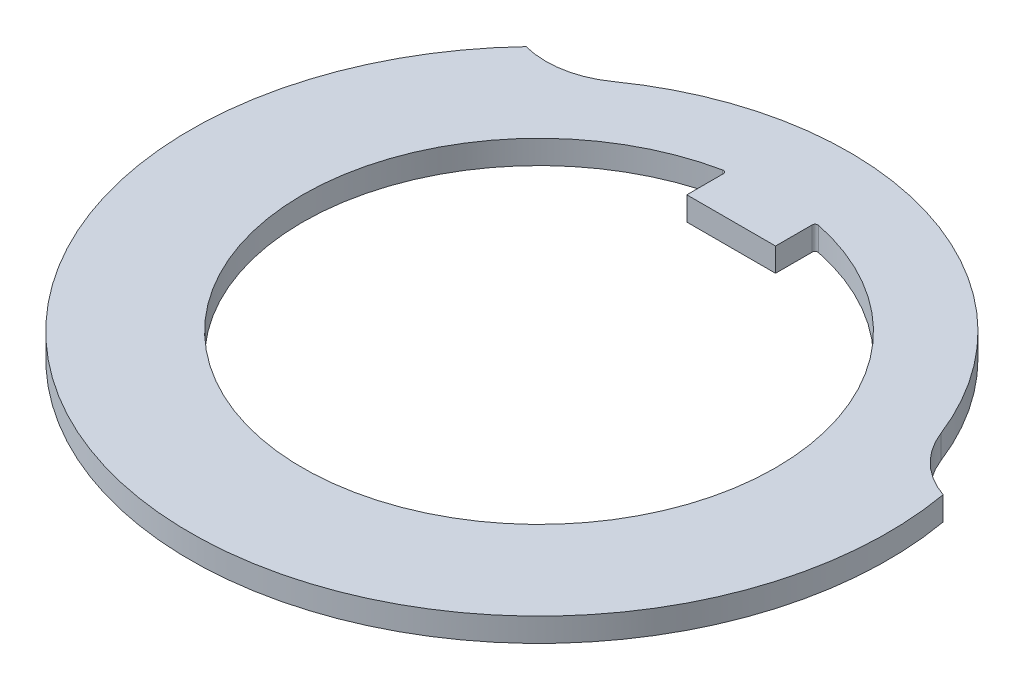
ISO-10303-21;
HEADER;
FILE_DESCRIPTION(('STEP AP214'),'2;1');
FILE_NAME('part.step','',(''),(''),'','','');
FILE_SCHEMA(('AUTOMOTIVE_DESIGN { 1 0 10303 214 1 1 1 1 }'));
ENDSEC;
DATA;
#1=APPLICATION_CONTEXT('core data for automotive mechanical design processes');
#2=APPLICATION_PROTOCOL_DEFINITION('international standard','automotive_design',2000,#1);
#3=PRODUCT_CONTEXT('',#1,'mechanical');
#4=PRODUCT('Part','Part','',(#3));
#5=PRODUCT_RELATED_PRODUCT_CATEGORY('part','',(#4));
#6=PRODUCT_DEFINITION_FORMATION('','',#4);
#7=PRODUCT_DEFINITION_CONTEXT('part definition',#1,'design');
#8=PRODUCT_DEFINITION('design','',#6,#7);
#9=PRODUCT_DEFINITION_SHAPE('','',#8);
#10=(LENGTH_UNIT() NAMED_UNIT(*) SI_UNIT(.MILLI.,.METRE.));
#11=(NAMED_UNIT(*) PLANE_ANGLE_UNIT() SI_UNIT($,.RADIAN.));
#12=(NAMED_UNIT(*) SI_UNIT($,.STERADIAN.) SOLID_ANGLE_UNIT());
#13=UNCERTAINTY_MEASURE_WITH_UNIT(LENGTH_MEASURE(1.E-05),#10,'distance_accuracy_value','');
#14=(GEOMETRIC_REPRESENTATION_CONTEXT(3) GLOBAL_UNCERTAINTY_ASSIGNED_CONTEXT((#13)) GLOBAL_UNIT_ASSIGNED_CONTEXT((#10,
#11,#12)) REPRESENTATION_CONTEXT('',''));
#15=CARTESIAN_POINT('',(0.,0.,0.));
#16=DIRECTION('',(0.,0.,1.));
#17=DIRECTION('',(1.,0.,0.));
#18=AXIS2_PLACEMENT_3D('',#15,#16,#17);
#19=CARTESIAN_POINT('',(6.29151805559133,0.8,-2.44526083601902));
#20=DIRECTION('',(0.,1.,0.));
#21=DIRECTION('',(0.,0.,1.));
#22=AXIS2_PLACEMENT_3D('',#19,#20,#21);
#23=PLANE('',#22);
#24=CARTESIAN_POINT('',(0.,0.8,0.));
#25=DIRECTION('',(0.,1.,0.));
#26=DIRECTION('',(0.,0.,1.));
#27=AXIS2_PLACEMENT_3D('',#24,#25,#26);
#28=CIRCLE('',#27,11.8);
#29=CARTESIAN_POINT('',(-8.55941757794496,0.8,-8.12258399318634));
#30=VERTEX_POINT('',#29);
#31=CARTESIAN_POINT('',(11.6207314855441,0.8,-2.04904849646967));
#32=VERTEX_POINT('',#31);
#33=EDGE_CURVE('E162',#30,#32,#28,.T.);
#34=ORIENTED_EDGE('',*,*,#33,.T.);
#35=CARTESIAN_POINT('',(12.5830361111827,0.8,-4.89052167203804));
#36=DIRECTION('',(0.,-1.,0.));
#37=DIRECTION('',(0.,0.,-1.));
#38=AXIS2_PLACEMENT_3D('',#35,#36,#37);
#39=CIRCLE('',#38,3.);
#40=CARTESIAN_POINT('',(9.78680586425318,0.8,-3.80373907825181));
#41=VERTEX_POINT('',#40);
#42=EDGE_CURVE('E165',#32,#41,#39,.T.);
#43=ORIENTED_EDGE('',*,*,#42,.T.);
#44=CARTESIAN_POINT('',(0.,0.8,0.));
#45=DIRECTION('',(0.,1.,0.));
#46=DIRECTION('',(0.,0.,1.));
#47=AXIS2_PLACEMENT_3D('',#44,#45,#46);
#48=CIRCLE('',#47,10.5);
#49=CARTESIAN_POINT('',(-6.06165437376044,0.8,-8.57358421274738));
#50=VERTEX_POINT('',#49);
#51=EDGE_CURVE('E168',#41,#50,#48,.T.);
#52=ORIENTED_EDGE('',*,*,#51,.T.);
#53=CARTESIAN_POINT('',(-7.79355562340628,0.8,-11.0231797021038));
#54=DIRECTION('',(0.,-1.,0.));
#55=DIRECTION('',(0.,0.,-1.));
#56=AXIS2_PLACEMENT_3D('',#53,#54,#55);
#57=CIRCLE('',#56,3.);
#58=EDGE_CURVE('E170',#50,#30,#57,.T.);
#59=ORIENTED_EDGE('',*,*,#58,.T.);
#60=EDGE_LOOP('',(#34,#43,#52,#59));
#61=FACE_BOUND('',#60,.T.);
#62=CARTESIAN_POINT('',(0.,0.8,0.));
#63=DIRECTION('',(0.,1.,0.));
#64=DIRECTION('',(0.,0.,1.));
#65=AXIS2_PLACEMENT_3D('',#62,#63,#64);
#66=CIRCLE('',#65,8.);
#67=CARTESIAN_POINT('',(-1.62025316455696,0.8,-7.83420574677122));
#68=VERTEX_POINT('',#67);
#69=CARTESIAN_POINT('',(1.62025316455696,0.8,-7.83420574677122));
#70=VERTEX_POINT('',#69);
#71=EDGE_CURVE('E147',#68,#70,#66,.T.);
#72=ORIENTED_EDGE('',*,*,#71,.F.);
#73=CARTESIAN_POINT('',(-1.6,0.8,-7.73627817493658));
#74=DIRECTION('',(0.,1.,0.));
#75=DIRECTION('',(0.,0.,1.));
#76=AXIS2_PLACEMENT_3D('',#73,#74,#75);
#77=CIRCLE('',#76,0.1);
#78=CARTESIAN_POINT('',(-1.5,0.8,-7.73627817493658));
#79=VERTEX_POINT('',#78);
#80=EDGE_CURVE('E146',#68,#79,#77,.F.);
#81=ORIENTED_EDGE('',*,*,#80,.T.);
#82=DIRECTION('',(0.,0.,-1.));
#83=VECTOR('',#82,1.);
#84=CARTESIAN_POINT('',(-1.5,0.8,-6.5));
#85=LINE('',#84,#83);
#86=CARTESIAN_POINT('',(-1.5,0.8,-6.5));
#87=VERTEX_POINT('',#86);
#88=EDGE_CURVE('E139',#87,#79,#85,.T.);
#89=ORIENTED_EDGE('',*,*,#88,.F.);
#90=DIRECTION('',(-1.,0.,0.));
#91=VECTOR('',#90,1.);
#92=CARTESIAN_POINT('',(-1.5,0.8,-6.5));
#93=LINE('',#92,#91);
#94=CARTESIAN_POINT('',(1.5,0.8,-6.5));
#95=VERTEX_POINT('',#94);
#96=EDGE_CURVE('E123',#95,#87,#93,.T.);
#97=ORIENTED_EDGE('',*,*,#96,.F.);
#98=DIRECTION('',(0.,0.,1.));
#99=VECTOR('',#98,1.);
#100=CARTESIAN_POINT('',(1.5,0.8,-6.5));
#101=LINE('',#100,#99);
#102=CARTESIAN_POINT('',(1.5,0.8,-7.73627817493658));
#103=VERTEX_POINT('',#102);
#104=EDGE_CURVE('E133',#103,#95,#101,.T.);
#105=ORIENTED_EDGE('',*,*,#104,.F.);
#106=CARTESIAN_POINT('',(1.6,0.8,-7.73627817493658));
#107=DIRECTION('',(0.,1.,0.));
#108=DIRECTION('',(0.,0.,1.));
#109=AXIS2_PLACEMENT_3D('',#106,#107,#108);
#110=CIRCLE('',#109,0.1);
#111=EDGE_CURVE('E13',#103,#70,#110,.F.);
#112=ORIENTED_EDGE('',*,*,#111,.T.);
#113=EDGE_LOOP('',(#72,#81,#89,#97,#105,#112));
#114=FACE_BOUND('',#113,.T.);
#115=ADVANCED_FACE('F47',(#61,#114),#23,.T.);
#116=CARTESIAN_POINT('',(6.29151805559133,0.,-2.44526083601902));
#117=DIRECTION('',(0.,1.,0.));
#118=DIRECTION('',(0.,0.,1.));
#119=AXIS2_PLACEMENT_3D('',#116,#117,#118);
#120=PLANE('',#119);
#121=CARTESIAN_POINT('',(0.,0.,0.));
#122=DIRECTION('',(0.,1.,0.));
#123=DIRECTION('',(0.,0.,1.));
#124=AXIS2_PLACEMENT_3D('',#121,#122,#123);
#125=CIRCLE('',#124,11.8);
#126=CARTESIAN_POINT('',(-8.55941757794496,0.,-8.12258399318634));
#127=VERTEX_POINT('',#126);
#128=CARTESIAN_POINT('',(11.6207314855441,0.,-2.04904849646967));
#129=VERTEX_POINT('',#128);
#130=EDGE_CURVE('E161',#127,#129,#125,.T.);
#131=ORIENTED_EDGE('',*,*,#130,.F.);
#132=CARTESIAN_POINT('',(-7.79355562340628,0.,-11.0231797021038));
#133=DIRECTION('',(0.,-1.,0.));
#134=DIRECTION('',(0.,0.,-1.));
#135=AXIS2_PLACEMENT_3D('',#132,#133,#134);
#136=CIRCLE('',#135,3.);
#137=CARTESIAN_POINT('',(-6.06165437376044,0.,-8.57358421274738));
#138=VERTEX_POINT('',#137);
#139=EDGE_CURVE('E166',#138,#127,#136,.T.);
#140=ORIENTED_EDGE('',*,*,#139,.F.);
#141=CARTESIAN_POINT('',(0.,0.,0.));
#142=DIRECTION('',(0.,1.,0.));
#143=DIRECTION('',(0.,0.,1.));
#144=AXIS2_PLACEMENT_3D('',#141,#142,#143);
#145=CIRCLE('',#144,10.5);
#146=CARTESIAN_POINT('',(9.78680586425318,0.,-3.80373907825181));
#147=VERTEX_POINT('',#146);
#148=EDGE_CURVE('E177',#147,#138,#145,.T.);
#149=ORIENTED_EDGE('',*,*,#148,.F.);
#150=CARTESIAN_POINT('',(12.5830361111827,0.,-4.89052167203804));
#151=DIRECTION('',(0.,-1.,0.));
#152=DIRECTION('',(0.,0.,-1.));
#153=AXIS2_PLACEMENT_3D('',#150,#151,#152);
#154=CIRCLE('',#153,3.);
#155=EDGE_CURVE('E175',#129,#147,#154,.T.);
#156=ORIENTED_EDGE('',*,*,#155,.F.);
#157=EDGE_LOOP('',(#131,#140,#149,#156));
#158=FACE_BOUND('',#157,.T.);
#159=DIRECTION('',(0.,0.,-1.));
#160=VECTOR('',#159,1.);
#161=CARTESIAN_POINT('',(-1.5,0.,-6.5));
#162=LINE('',#161,#160);
#163=CARTESIAN_POINT('',(-1.5,0.,-6.5));
#164=VERTEX_POINT('',#163);
#165=CARTESIAN_POINT('',(-1.5,0.,-7.73627817493658));
#166=VERTEX_POINT('',#165);
#167=EDGE_CURVE('E142',#164,#166,#162,.T.);
#168=ORIENTED_EDGE('',*,*,#167,.T.);
#169=CARTESIAN_POINT('',(-1.6,0.,-7.73627817493658));
#170=DIRECTION('',(0.,1.,0.));
#171=DIRECTION('',(0.,0.,1.));
#172=AXIS2_PLACEMENT_3D('',#169,#170,#171);
#173=CIRCLE('',#172,0.1);
#174=CARTESIAN_POINT('',(-1.62025316455696,0.,-7.83420574677122));
#175=VERTEX_POINT('',#174);
#176=EDGE_CURVE('E199',#166,#175,#173,.T.);
#177=ORIENTED_EDGE('',*,*,#176,.T.);
#178=CARTESIAN_POINT('',(0.,0.,0.));
#179=DIRECTION('',(0.,1.,0.));
#180=DIRECTION('',(0.,0.,1.));
#181=AXIS2_PLACEMENT_3D('',#178,#179,#180);
#182=CIRCLE('',#181,8.);
#183=CARTESIAN_POINT('',(1.62025316455696,0.,-7.83420574677122));
#184=VERTEX_POINT('',#183);
#185=EDGE_CURVE('E157',#175,#184,#182,.T.);
#186=ORIENTED_EDGE('',*,*,#185,.T.);
#187=CARTESIAN_POINT('',(1.6,0.,-7.73627817493658));
#188=DIRECTION('',(0.,1.,0.));
#189=DIRECTION('',(0.,0.,1.));
#190=AXIS2_PLACEMENT_3D('',#187,#188,#189);
#191=CIRCLE('',#190,0.1);
#192=CARTESIAN_POINT('',(1.5,0.,-7.73627817493658));
#193=VERTEX_POINT('',#192);
#194=EDGE_CURVE('E55',#184,#193,#191,.T.);
#195=ORIENTED_EDGE('',*,*,#194,.T.);
#196=DIRECTION('',(0.,0.,1.));
#197=VECTOR('',#196,1.);
#198=CARTESIAN_POINT('',(1.5,0.,-6.5));
#199=LINE('',#198,#197);
#200=CARTESIAN_POINT('',(1.5,0.,-6.5));
#201=VERTEX_POINT('',#200);
#202=EDGE_CURVE('E152',#193,#201,#199,.T.);
#203=ORIENTED_EDGE('',*,*,#202,.T.);
#204=DIRECTION('',(-1.,0.,0.));
#205=VECTOR('',#204,1.);
#206=CARTESIAN_POINT('',(-1.5,0.,-6.5));
#207=LINE('',#206,#205);
#208=EDGE_CURVE('E148',#201,#164,#207,.T.);
#209=ORIENTED_EDGE('',*,*,#208,.T.);
#210=EDGE_LOOP('',(#168,#177,#186,#195,#203,#209));
#211=FACE_BOUND('',#210,.T.);
#212=ADVANCED_FACE('F202',(#158,#211),#120,.F.);
#213=CARTESIAN_POINT('',(0.,0.8,0.));
#214=DIRECTION('',(0.,-1.,0.));
#215=DIRECTION('',(0.,0.,-1.));
#216=AXIS2_PLACEMENT_3D('',#213,#214,#215);
#217=CYLINDRICAL_SURFACE('',#216,11.8);
#218=ORIENTED_EDGE('',*,*,#130,.T.);
#219=DIRECTION('',(0.,-1.,0.));
#220=VECTOR('',#219,1.);
#221=CARTESIAN_POINT('',(11.6207314855441,0.8,-2.04904849646967));
#222=LINE('',#221,#220);
#223=EDGE_CURVE('E188',#32,#129,#222,.T.);
#224=ORIENTED_EDGE('',*,*,#223,.F.);
#225=ORIENTED_EDGE('',*,*,#33,.F.);
#226=DIRECTION('',(0.,-1.,0.));
#227=VECTOR('',#226,1.);
#228=CARTESIAN_POINT('',(-8.55941757794496,0.8,-8.12258399318634));
#229=LINE('',#228,#227);
#230=EDGE_CURVE('E172',#30,#127,#229,.T.);
#231=ORIENTED_EDGE('',*,*,#230,.T.);
#232=EDGE_LOOP('',(#218,#224,#225,#231));
#233=FACE_BOUND('',#232,.T.);
#234=ADVANCED_FACE('F224',(#233),#217,.T.);
#235=CARTESIAN_POINT('',(12.5830361111827,0.8,-4.89052167203804));
#236=DIRECTION('',(0.,-1.,0.));
#237=DIRECTION('',(0.,0.,-1.));
#238=AXIS2_PLACEMENT_3D('',#235,#236,#237);
#239=CYLINDRICAL_SURFACE('',#238,3.);
#240=ORIENTED_EDGE('',*,*,#155,.T.);
#241=DIRECTION('',(0.,-1.,0.));
#242=VECTOR('',#241,1.);
#243=CARTESIAN_POINT('',(9.78680586425318,0.8,-3.80373907825181));
#244=LINE('',#243,#242);
#245=EDGE_CURVE('E185',#41,#147,#244,.T.);
#246=ORIENTED_EDGE('',*,*,#245,.F.);
#247=ORIENTED_EDGE('',*,*,#42,.F.);
#248=ORIENTED_EDGE('',*,*,#223,.T.);
#249=EDGE_LOOP('',(#240,#246,#247,#248));
#250=FACE_BOUND('',#249,.T.);
#251=ADVANCED_FACE('F237',(#250),#239,.F.);
#252=CARTESIAN_POINT('',(0.,0.8,0.));
#253=DIRECTION('',(0.,-1.,0.));
#254=DIRECTION('',(0.,0.,-1.));
#255=AXIS2_PLACEMENT_3D('',#252,#253,#254);
#256=CYLINDRICAL_SURFACE('',#255,10.5);
#257=ORIENTED_EDGE('',*,*,#148,.T.);
#258=DIRECTION('',(0.,-1.,0.));
#259=VECTOR('',#258,1.);
#260=CARTESIAN_POINT('',(-6.06165437376044,0.8,-8.57358421274738));
#261=LINE('',#260,#259);
#262=EDGE_CURVE('E182',#50,#138,#261,.T.);
#263=ORIENTED_EDGE('',*,*,#262,.F.);
#264=ORIENTED_EDGE('',*,*,#51,.F.);
#265=ORIENTED_EDGE('',*,*,#245,.T.);
#266=EDGE_LOOP('',(#257,#263,#264,#265));
#267=FACE_BOUND('',#266,.T.);
#268=ADVANCED_FACE('F233',(#267),#256,.T.);
#269=CARTESIAN_POINT('',(-7.79355562340628,0.8,-11.0231797021038));
#270=DIRECTION('',(0.,-1.,0.));
#271=DIRECTION('',(0.,0.,-1.));
#272=AXIS2_PLACEMENT_3D('',#269,#270,#271);
#273=CYLINDRICAL_SURFACE('',#272,3.);
#274=ORIENTED_EDGE('',*,*,#139,.T.);
#275=ORIENTED_EDGE('',*,*,#230,.F.);
#276=ORIENTED_EDGE('',*,*,#58,.F.);
#277=ORIENTED_EDGE('',*,*,#262,.T.);
#278=EDGE_LOOP('',(#274,#275,#276,#277));
#279=FACE_BOUND('',#278,.T.);
#280=ADVANCED_FACE('F230',(#279),#273,.F.);
#281=CARTESIAN_POINT('',(-1.5,0.8,-6.5));
#282=DIRECTION('',(-1.,0.,0.));
#283=DIRECTION('',(0.,0.,1.));
#284=AXIS2_PLACEMENT_3D('',#281,#282,#283);
#285=PLANE('',#284);
#286=ORIENTED_EDGE('',*,*,#88,.T.);
#287=DIRECTION('',(0.,1.,0.));
#288=VECTOR('',#287,1.);
#289=CARTESIAN_POINT('',(-1.5,0.,-7.73627817493658));
#290=LINE('',#289,#288);
#291=EDGE_CURVE('E191',#79,#166,#290,.F.);
#292=ORIENTED_EDGE('',*,*,#291,.T.);
#293=ORIENTED_EDGE('',*,*,#167,.F.);
#294=DIRECTION('',(0.,-1.,0.));
#295=VECTOR('',#294,1.);
#296=CARTESIAN_POINT('',(-1.5,0.8,-6.5));
#297=LINE('',#296,#295);
#298=EDGE_CURVE('E127',#87,#164,#297,.T.);
#299=ORIENTED_EDGE('',*,*,#298,.F.);
#300=EDGE_LOOP('',(#286,#292,#293,#299));
#301=FACE_BOUND('',#300,.T.);
#302=ADVANCED_FACE('F137',(#301),#285,.T.);
#303=CARTESIAN_POINT('',(0.,0.8,0.));
#304=DIRECTION('',(0.,-1.,0.));
#305=DIRECTION('',(0.,0.,-1.));
#306=AXIS2_PLACEMENT_3D('',#303,#304,#305);
#307=CYLINDRICAL_SURFACE('',#306,8.);
#308=ORIENTED_EDGE('',*,*,#185,.F.);
#309=DIRECTION('',(0.,-1.,0.));
#310=VECTOR('',#309,1.);
#311=CARTESIAN_POINT('',(-1.62025316455696,0.8,-7.83420574677122));
#312=LINE('',#311,#310);
#313=EDGE_CURVE('E196',#175,#68,#312,.F.);
#314=ORIENTED_EDGE('',*,*,#313,.T.);
#315=ORIENTED_EDGE('',*,*,#71,.T.);
#316=DIRECTION('',(0.,-1.,0.));
#317=VECTOR('',#316,1.);
#318=CARTESIAN_POINT('',(1.62025316455696,0.8,-7.83420574677122));
#319=LINE('',#318,#317);
#320=EDGE_CURVE('E193',#70,#184,#319,.T.);
#321=ORIENTED_EDGE('',*,*,#320,.T.);
#322=EDGE_LOOP('',(#308,#314,#315,#321));
#323=FACE_BOUND('',#322,.T.);
#324=ADVANCED_FACE('F206',(#323),#307,.F.);
#325=CARTESIAN_POINT('',(1.5,0.8,-6.5));
#326=DIRECTION('',(1.,0.,0.));
#327=DIRECTION('',(0.,0.,-1.));
#328=AXIS2_PLACEMENT_3D('',#325,#326,#327);
#329=PLANE('',#328);
#330=ORIENTED_EDGE('',*,*,#202,.F.);
#331=DIRECTION('',(0.,1.,0.));
#332=VECTOR('',#331,1.);
#333=CARTESIAN_POINT('',(1.5,0.8,-7.73627817493658));
#334=LINE('',#333,#332);
#335=EDGE_CURVE('E62',#193,#103,#334,.T.);
#336=ORIENTED_EDGE('',*,*,#335,.T.);
#337=ORIENTED_EDGE('',*,*,#104,.T.);
#338=DIRECTION('',(0.,-1.,0.));
#339=VECTOR('',#338,1.);
#340=CARTESIAN_POINT('',(1.5,0.8,-6.5));
#341=LINE('',#340,#339);
#342=EDGE_CURVE('E130',#95,#201,#341,.T.);
#343=ORIENTED_EDGE('',*,*,#342,.T.);
#344=EDGE_LOOP('',(#330,#336,#337,#343));
#345=FACE_BOUND('',#344,.T.);
#346=ADVANCED_FACE('F215',(#345),#329,.T.);
#347=CARTESIAN_POINT('',(-1.5,0.8,-6.5));
#348=DIRECTION('',(0.,0.,1.));
#349=DIRECTION('',(1.,0.,0.));
#350=AXIS2_PLACEMENT_3D('',#347,#348,#349);
#351=PLANE('',#350);
#352=ORIENTED_EDGE('',*,*,#208,.F.);
#353=ORIENTED_EDGE('',*,*,#342,.F.);
#354=ORIENTED_EDGE('',*,*,#96,.T.);
#355=ORIENTED_EDGE('',*,*,#298,.T.);
#356=EDGE_LOOP('',(#352,#353,#354,#355));
#357=FACE_BOUND('',#356,.T.);
#358=ADVANCED_FACE('F126',(#357),#351,.T.);
#359=CARTESIAN_POINT('',(-1.6,0.8,-7.73627817493658));
#360=DIRECTION('',(0.,-1.,0.));
#361=DIRECTION('',(0.,0.,-1.));
#362=AXIS2_PLACEMENT_3D('',#359,#360,#361);
#363=CYLINDRICAL_SURFACE('',#362,0.1);
#364=ORIENTED_EDGE('',*,*,#80,.F.);
#365=ORIENTED_EDGE('',*,*,#313,.F.);
#366=ORIENTED_EDGE('',*,*,#176,.F.);
#367=ORIENTED_EDGE('',*,*,#291,.F.);
#368=EDGE_LOOP('',(#364,#365,#366,#367));
#369=FACE_BOUND('',#368,.T.);
#370=ADVANCED_FACE('F208',(#369),#363,.F.);
#371=CARTESIAN_POINT('',(1.6,0.8,-7.73627817493658));
#372=DIRECTION('',(0.,-1.,0.));
#373=DIRECTION('',(0.,0.,-1.));
#374=AXIS2_PLACEMENT_3D('',#371,#372,#373);
#375=CYLINDRICAL_SURFACE('',#374,0.1);
#376=ORIENTED_EDGE('',*,*,#111,.F.);
#377=ORIENTED_EDGE('',*,*,#335,.F.);
#378=ORIENTED_EDGE('',*,*,#194,.F.);
#379=ORIENTED_EDGE('',*,*,#320,.F.);
#380=EDGE_LOOP('',(#376,#377,#378,#379));
#381=FACE_BOUND('',#380,.T.);
#382=ADVANCED_FACE('F49',(#381),#375,.F.);
#383=CLOSED_SHELL('',(#115,#212,#234,#251,#268,#280,#302,#324,#346,#358,#370,#382));
#384=MANIFOLD_SOLID_BREP('B2',#383);
#385=ADVANCED_BREP_SHAPE_REPRESENTATION('',(#18,#384),#14);
#386=SHAPE_DEFINITION_REPRESENTATION(#9,#385);
ENDSEC;
END-ISO-10303-21;
